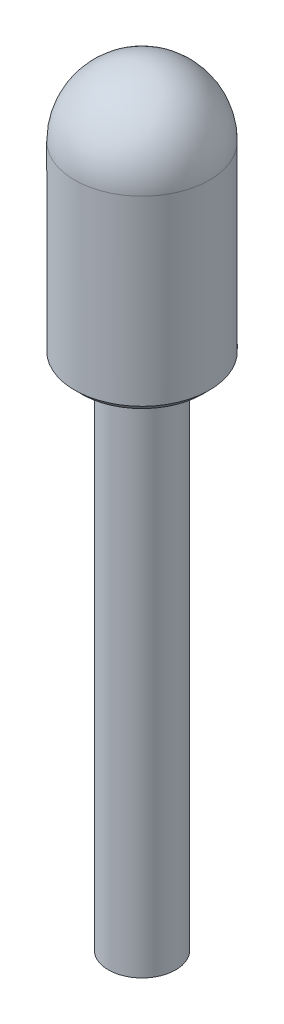
ISO-10303-21;
HEADER;
FILE_DESCRIPTION(('STEP AP214'),'2;1');
FILE_NAME('part.step','',(''),(''),'','','');
FILE_SCHEMA(('AUTOMOTIVE_DESIGN { 1 0 10303 214 1 1 1 1 }'));
ENDSEC;
DATA;
#1=APPLICATION_CONTEXT('core data for automotive mechanical design processes');
#2=APPLICATION_PROTOCOL_DEFINITION('international standard','automotive_design',2000,#1);
#3=PRODUCT_CONTEXT('',#1,'mechanical');
#4=PRODUCT('Part','Part','',(#3));
#5=PRODUCT_RELATED_PRODUCT_CATEGORY('part','',(#4));
#6=PRODUCT_DEFINITION_FORMATION('','',#4);
#7=PRODUCT_DEFINITION_CONTEXT('part definition',#1,'design');
#8=PRODUCT_DEFINITION('design','',#6,#7);
#9=PRODUCT_DEFINITION_SHAPE('','',#8);
#10=(LENGTH_UNIT() NAMED_UNIT(*) SI_UNIT(.MILLI.,.METRE.));
#11=(NAMED_UNIT(*) PLANE_ANGLE_UNIT() SI_UNIT($,.RADIAN.));
#12=(NAMED_UNIT(*) SI_UNIT($,.STERADIAN.) SOLID_ANGLE_UNIT());
#13=UNCERTAINTY_MEASURE_WITH_UNIT(LENGTH_MEASURE(1.E-05),#10,'distance_accuracy_value','');
#14=(GEOMETRIC_REPRESENTATION_CONTEXT(3) GLOBAL_UNCERTAINTY_ASSIGNED_CONTEXT((#13)) GLOBAL_UNIT_ASSIGNED_CONTEXT((#10,
#11,#12)) REPRESENTATION_CONTEXT('',''));
#15=CARTESIAN_POINT('',(0.,0.,0.));
#16=DIRECTION('',(0.,0.,1.));
#17=DIRECTION('',(1.,0.,0.));
#18=AXIS2_PLACEMENT_3D('',#15,#16,#17);
#19=CARTESIAN_POINT('',(0.,0.,0.));
#20=DIRECTION('',(0.,-1.,0.));
#21=DIRECTION('',(0.,0.,-1.));
#22=AXIS2_PLACEMENT_3D('',#19,#20,#21);
#23=PLANE('',#22);
#24=CARTESIAN_POINT('',(0.,0.,0.));
#25=DIRECTION('',(0.,-1.,0.));
#26=DIRECTION('',(0.,0.,-1.));
#27=AXIS2_PLACEMENT_3D('',#24,#25,#26);
#28=CIRCLE('',#27,0.5);
#29=CARTESIAN_POINT('',(0.,0.,-0.5));
#30=VERTEX_POINT('',#29);
#31=EDGE_CURVE('E43',#30,#30,#28,.T.);
#32=ORIENTED_EDGE('',*,*,#31,.T.);
#33=EDGE_LOOP('',(#32));
#34=FACE_BOUND('',#33,.T.);
#35=ADVANCED_FACE('F32',(#34),#23,.T.);
#36=CARTESIAN_POINT('',(0.,0.,0.));
#37=DIRECTION('',(0.,-1.,0.));
#38=DIRECTION('',(0.,0.,-1.));
#39=AXIS2_PLACEMENT_3D('',#36,#37,#38);
#40=CYLINDRICAL_SURFACE('',#39,0.5);
#41=CARTESIAN_POINT('',(0.,7.6,0.));
#42=DIRECTION('',(0.,-1.,0.));
#43=DIRECTION('',(0.,0.,-1.));
#44=AXIS2_PLACEMENT_3D('',#41,#42,#43);
#45=CIRCLE('',#44,0.5);
#46=CARTESIAN_POINT('',(0.,7.6,-0.5));
#47=VERTEX_POINT('',#46);
#48=EDGE_CURVE('E47',#47,#47,#45,.T.);
#49=ORIENTED_EDGE('',*,*,#48,.T.);
#50=EDGE_LOOP('',(#49));
#51=FACE_BOUND('',#50,.T.);
#52=ORIENTED_EDGE('',*,*,#31,.F.);
#53=EDGE_LOOP('',(#52));
#54=FACE_BOUND('',#53,.T.);
#55=ADVANCED_FACE('F69',(#51,#54),#40,.T.);
#56=CARTESIAN_POINT('',(0.5,7.6,0.));
#57=DIRECTION('',(0.,-1.,0.));
#58=DIRECTION('',(0.,0.,-1.));
#59=AXIS2_PLACEMENT_3D('',#56,#57,#58);
#60=PLANE('',#59);
#61=CARTESIAN_POINT('',(0.,7.6,0.));
#62=DIRECTION('',(0.,-1.,0.));
#63=DIRECTION('',(0.,0.,-1.));
#64=AXIS2_PLACEMENT_3D('',#61,#62,#63);
#65=CIRCLE('',#64,0.899999999999998);
#66=CARTESIAN_POINT('',(0.,7.6,-0.899999999999998));
#67=VERTEX_POINT('',#66);
#68=EDGE_CURVE('E39',#67,#67,#65,.T.);
#69=ORIENTED_EDGE('',*,*,#68,.T.);
#70=EDGE_LOOP('',(#69));
#71=FACE_BOUND('',#70,.T.);
#72=ORIENTED_EDGE('',*,*,#48,.F.);
#73=EDGE_LOOP('',(#72));
#74=FACE_BOUND('',#73,.T.);
#75=ADVANCED_FACE('F66',(#71,#74),#60,.T.);
#76=CARTESIAN_POINT('',(0.,0.,0.));
#77=DIRECTION('',(0.,-1.,0.));
#78=DIRECTION('',(0.,0.,-1.));
#79=AXIS2_PLACEMENT_3D('',#76,#77,#78);
#80=CYLINDRICAL_SURFACE('',#79,1.);
#81=CARTESIAN_POINT('',(0.,7.7,0.));
#82=DIRECTION('',(0.,-1.,0.));
#83=DIRECTION('',(0.,0.,-1.));
#84=AXIS2_PLACEMENT_3D('',#81,#82,#83);
#85=CIRCLE('',#84,1.);
#86=CARTESIAN_POINT('',(0.,7.7,-1.));
#87=VERTEX_POINT('',#86);
#88=EDGE_CURVE('E10',#87,#87,#85,.F.);
#89=ORIENTED_EDGE('',*,*,#88,.T.);
#90=EDGE_LOOP('',(#89));
#91=FACE_BOUND('',#90,.T.);
#92=CARTESIAN_POINT('',(0.,10.4,0.));
#93=DIRECTION('',(0.,-1.,0.));
#94=DIRECTION('',(0.,0.,-1.));
#95=AXIS2_PLACEMENT_3D('',#92,#93,#94);
#96=CIRCLE('',#95,1.);
#97=CARTESIAN_POINT('',(0.,10.4,-1.));
#98=VERTEX_POINT('',#97);
#99=EDGE_CURVE('E52',#98,#98,#96,.T.);
#100=ORIENTED_EDGE('',*,*,#99,.T.);
#101=EDGE_LOOP('',(#100));
#102=FACE_BOUND('',#101,.T.);
#103=ADVANCED_FACE('F56',(#91,#102),#80,.T.);
#104=CARTESIAN_POINT('',(0.,10.4,0.));
#105=DIRECTION('',(0.,-1.,0.));
#106=DIRECTION('',(1.,0.,0.));
#107=AXIS2_PLACEMENT_3D('',#104,#105,#106);
#108=SPHERICAL_SURFACE('',#107,1.);
#109=ORIENTED_EDGE('',*,*,#99,.F.);
#110=EDGE_LOOP('',(#109));
#111=FACE_BOUND('',#110,.T.);
#112=ADVANCED_FACE('F58',(#111),#108,.T.);
#113=CARTESIAN_POINT('',(0.,7.6,0.));
#114=DIRECTION('',(0.,1.,0.));
#115=DIRECTION('',(0.,0.,1.));
#116=AXIS2_PLACEMENT_3D('',#113,#114,#115);
#117=CONICAL_SURFACE('',#116,0.899999999999998,0.785398163397448);
#118=ORIENTED_EDGE('',*,*,#88,.F.);
#119=EDGE_LOOP('',(#118));
#120=FACE_BOUND('',#119,.T.);
#121=ORIENTED_EDGE('',*,*,#68,.F.);
#122=EDGE_LOOP('',(#121));
#123=FACE_BOUND('',#122,.T.);
#124=ADVANCED_FACE('F34',(#120,#123),#117,.T.);
#125=CLOSED_SHELL('',(#35,#55,#75,#103,#112,#124));
#126=MANIFOLD_SOLID_BREP('B2',#125);
#127=ADVANCED_BREP_SHAPE_REPRESENTATION('',(#18,#126),#14);
#128=SHAPE_DEFINITION_REPRESENTATION(#9,#127);
ENDSEC;
END-ISO-10303-21;
